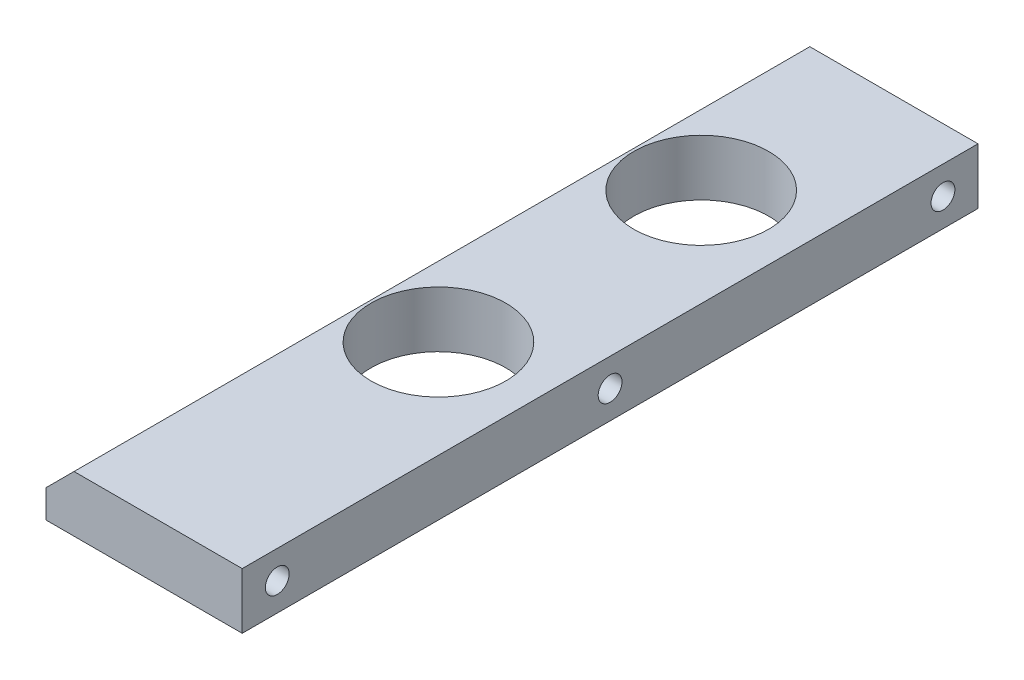
ISO-10303-21;
HEADER;
FILE_DESCRIPTION(('STEP AP214'),'2;1');
FILE_NAME('part.step','',(''),(''),'','','');
FILE_SCHEMA(('AUTOMOTIVE_DESIGN { 1 0 10303 214 1 1 1 1 }'));
ENDSEC;
DATA;
#1=APPLICATION_CONTEXT('core data for automotive mechanical design processes');
#2=APPLICATION_PROTOCOL_DEFINITION('international standard','automotive_design',2000,#1);
#3=PRODUCT_CONTEXT('',#1,'mechanical');
#4=PRODUCT('Part','Part','',(#3));
#5=PRODUCT_RELATED_PRODUCT_CATEGORY('part','',(#4));
#6=PRODUCT_DEFINITION_FORMATION('','',#4);
#7=PRODUCT_DEFINITION_CONTEXT('part definition',#1,'design');
#8=PRODUCT_DEFINITION('design','',#6,#7);
#9=PRODUCT_DEFINITION_SHAPE('','',#8);
#10=(LENGTH_UNIT() NAMED_UNIT(*) SI_UNIT(.MILLI.,.METRE.));
#11=(NAMED_UNIT(*) PLANE_ANGLE_UNIT() SI_UNIT($,.RADIAN.));
#12=(NAMED_UNIT(*) SI_UNIT($,.STERADIAN.) SOLID_ANGLE_UNIT());
#13=UNCERTAINTY_MEASURE_WITH_UNIT(LENGTH_MEASURE(1.E-05),#10,'distance_accuracy_value','');
#14=(GEOMETRIC_REPRESENTATION_CONTEXT(3) GLOBAL_UNCERTAINTY_ASSIGNED_CONTEXT((#13)) GLOBAL_UNIT_ASSIGNED_CONTEXT((#10,
#11,#12)) REPRESENTATION_CONTEXT('',''));
#15=CARTESIAN_POINT('',(0.,0.,0.));
#16=DIRECTION('',(0.,0.,1.));
#17=DIRECTION('',(1.,0.,0.));
#18=AXIS2_PLACEMENT_3D('',#15,#16,#17);
#19=CARTESIAN_POINT('',(13.0000000000337,8.,95.));
#20=DIRECTION('',(1.,0.,0.));
#21=DIRECTION('',(0.,1.,0.));
#22=AXIS2_PLACEMENT_3D('',#19,#20,#21);
#23=CONICAL_SURFACE('',#22,3.3999999999719,1.02974425866659);
#24=CARTESIAN_POINT('',(10.9570738953551,8.00000000006662,95.));
#25=VERTEX_POINT('',#24);
#26=VERTEX_LOOP('',#25);
#27=FACE_BOUND('',#26,.T.);
#28=CARTESIAN_POINT('',(13.,8.,95.));
#29=DIRECTION('',(1.,0.,0.));
#30=DIRECTION('',(0.,0.,-1.));
#31=AXIS2_PLACEMENT_3D('',#28,#29,#30);
#32=CIRCLE('',#31,3.4);
#33=CARTESIAN_POINT('',(13.,8.,91.6));
#34=VERTEX_POINT('',#33);
#35=EDGE_CURVE('E93',#34,#34,#32,.T.);
#36=ORIENTED_EDGE('',*,*,#35,.T.);
#37=EDGE_LOOP('',(#36));
#38=FACE_BOUND('',#37,.T.);
#39=ADVANCED_FACE('F17',(#27,#38),#23,.F.);
#40=CARTESIAN_POINT('',(12.9999999998631,8.,0.));
#41=DIRECTION('',(1.,0.,0.));
#42=DIRECTION('',(0.,1.,0.));
#43=AXIS2_PLACEMENT_3D('',#40,#41,#42);
#44=CONICAL_SURFACE('',#43,3.39999999982865,1.02974425858268);
#45=CARTESIAN_POINT('',(10.9570738951561,8.00000000018031,0.));
#46=VERTEX_POINT('',#45);
#47=VERTEX_LOOP('',#46);
#48=FACE_BOUND('',#47,.T.);
#49=CARTESIAN_POINT('',(13.,8.,0.));
#50=DIRECTION('',(1.,0.,0.));
#51=DIRECTION('',(0.,0.,-1.));
#52=AXIS2_PLACEMENT_3D('',#49,#50,#51);
#53=CIRCLE('',#52,3.4);
#54=CARTESIAN_POINT('',(13.,8.,-3.4));
#55=VERTEX_POINT('',#54);
#56=EDGE_CURVE('E95',#55,#55,#53,.T.);
#57=ORIENTED_EDGE('',*,*,#56,.T.);
#58=EDGE_LOOP('',(#57));
#59=FACE_BOUND('',#58,.T.);
#60=ADVANCED_FACE('F90',(#48,#59),#44,.F.);
#61=CARTESIAN_POINT('',(13.0000000000337,8.,-95.));
#62=DIRECTION('',(1.,0.,0.));
#63=DIRECTION('',(0.,1.,0.));
#64=AXIS2_PLACEMENT_3D('',#61,#62,#63);
#65=CONICAL_SURFACE('',#64,3.39999999996962,1.02974425866599);
#66=CARTESIAN_POINT('',(10.9570738953266,8.00000000000978,-95.));
#67=VERTEX_POINT('',#66);
#68=VERTEX_LOOP('',#67);
#69=FACE_BOUND('',#68,.T.);
#70=CARTESIAN_POINT('',(13.,8.,-95.));
#71=DIRECTION('',(1.,0.,0.));
#72=DIRECTION('',(0.,0.,-1.));
#73=AXIS2_PLACEMENT_3D('',#70,#71,#72);
#74=CIRCLE('',#73,3.4);
#75=CARTESIAN_POINT('',(13.,8.,-98.4));
#76=VERTEX_POINT('',#75);
#77=EDGE_CURVE('E98',#76,#76,#74,.T.);
#78=ORIENTED_EDGE('',*,*,#77,.T.);
#79=EDGE_LOOP('',(#78));
#80=FACE_BOUND('',#79,.T.);
#81=ADVANCED_FACE('F205',(#69,#80),#65,.F.);
#82=CARTESIAN_POINT('',(10.1049275901,8.,95.));
#83=DIRECTION('',(1.,0.,0.));
#84=DIRECTION('',(0.,0.,-1.));
#85=AXIS2_PLACEMENT_3D('',#82,#83,#84);
#86=CYLINDRICAL_SURFACE('',#85,3.4);
#87=ORIENTED_EDGE('',*,*,#35,.F.);
#88=EDGE_LOOP('',(#87));
#89=FACE_BOUND('',#88,.T.);
#90=CARTESIAN_POINT('',(28.,8.,95.));
#91=DIRECTION('',(1.,0.,0.));
#92=DIRECTION('',(0.,0.,-1.));
#93=AXIS2_PLACEMENT_3D('',#90,#91,#92);
#94=CIRCLE('',#93,3.4);
#95=CARTESIAN_POINT('',(28.,8.,91.6));
#96=VERTEX_POINT('',#95);
#97=EDGE_CURVE('E20',#96,#96,#94,.F.);
#98=ORIENTED_EDGE('',*,*,#97,.F.);
#99=EDGE_LOOP('',(#98));
#100=FACE_BOUND('',#99,.T.);
#101=ADVANCED_FACE('F346',(#89,#100),#86,.F.);
#102=CARTESIAN_POINT('',(10.1049275901,8.,0.));
#103=DIRECTION('',(1.,0.,0.));
#104=DIRECTION('',(0.,0.,-1.));
#105=AXIS2_PLACEMENT_3D('',#102,#103,#104);
#106=CYLINDRICAL_SURFACE('',#105,3.4);
#107=ORIENTED_EDGE('',*,*,#56,.F.);
#108=EDGE_LOOP('',(#107));
#109=FACE_BOUND('',#108,.T.);
#110=CARTESIAN_POINT('',(28.,8.,0.));
#111=DIRECTION('',(1.,0.,0.));
#112=DIRECTION('',(0.,0.,-1.));
#113=AXIS2_PLACEMENT_3D('',#110,#111,#112);
#114=CIRCLE('',#113,3.4);
#115=CARTESIAN_POINT('',(28.,8.,-3.4));
#116=VERTEX_POINT('',#115);
#117=EDGE_CURVE('E128',#116,#116,#114,.F.);
#118=ORIENTED_EDGE('',*,*,#117,.F.);
#119=EDGE_LOOP('',(#118));
#120=FACE_BOUND('',#119,.T.);
#121=ADVANCED_FACE('F211',(#109,#120),#106,.F.);
#122=CARTESIAN_POINT('',(10.1049275901,8.,-95.));
#123=DIRECTION('',(1.,0.,0.));
#124=DIRECTION('',(0.,0.,-1.));
#125=AXIS2_PLACEMENT_3D('',#122,#123,#124);
#126=CYLINDRICAL_SURFACE('',#125,3.4);
#127=ORIENTED_EDGE('',*,*,#77,.F.);
#128=EDGE_LOOP('',(#127));
#129=FACE_BOUND('',#128,.T.);
#130=CARTESIAN_POINT('',(28.,8.,-95.));
#131=DIRECTION('',(1.,0.,0.));
#132=DIRECTION('',(0.,0.,-1.));
#133=AXIS2_PLACEMENT_3D('',#130,#131,#132);
#134=CIRCLE('',#133,3.4);
#135=CARTESIAN_POINT('',(28.,8.,-98.4));
#136=VERTEX_POINT('',#135);
#137=EDGE_CURVE('E125',#136,#136,#134,.F.);
#138=ORIENTED_EDGE('',*,*,#137,.F.);
#139=EDGE_LOOP('',(#138));
#140=FACE_BOUND('',#139,.T.);
#141=ADVANCED_FACE('F207',(#129,#140),#126,.F.);
#142=CARTESIAN_POINT('',(-24.,12.,0.));
#143=DIRECTION('',(-0.707106781186548,0.707106781186548,0.));
#144=DIRECTION('',(-0.707106781186548,-0.707106781186548,0.));
#145=AXIS2_PLACEMENT_3D('',#142,#143,#144);
#146=PLANE('',#145);
#147=DIRECTION('',(0.,0.,1.));
#148=VECTOR('',#147,1.);
#149=CARTESIAN_POINT('',(-28.,8.,-105.));
#150=LINE('',#149,#148);
#151=CARTESIAN_POINT('',(-28.,8.,105.));
#152=VERTEX_POINT('',#151);
#153=CARTESIAN_POINT('',(-28.,8.,-105.));
#154=VERTEX_POINT('',#153);
#155=EDGE_CURVE('E154',#152,#154,#150,.F.);
#156=ORIENTED_EDGE('',*,*,#155,.F.);
#157=DIRECTION('',(-0.707106781186548,-0.707106781186548,0.));
#158=VECTOR('',#157,1.);
#159=CARTESIAN_POINT('',(-20.,16.,105.));
#160=LINE('',#159,#158);
#161=CARTESIAN_POINT('',(-20.,16.,105.));
#162=VERTEX_POINT('',#161);
#163=EDGE_CURVE('E142',#162,#152,#160,.T.);
#164=ORIENTED_EDGE('',*,*,#163,.F.);
#165=DIRECTION('',(0.,0.,1.));
#166=VECTOR('',#165,1.);
#167=CARTESIAN_POINT('',(-20.,16.,0.));
#168=LINE('',#167,#166);
#169=CARTESIAN_POINT('',(-20.,16.,-105.));
#170=VERTEX_POINT('',#169);
#171=EDGE_CURVE('E201',#170,#162,#168,.T.);
#172=ORIENTED_EDGE('',*,*,#171,.F.);
#173=DIRECTION('',(0.707106781186548,0.707106781186548,0.));
#174=VECTOR('',#173,1.);
#175=CARTESIAN_POINT('',(-28.,8.,-105.));
#176=LINE('',#175,#174);
#177=EDGE_CURVE('E124',#154,#170,#176,.T.);
#178=ORIENTED_EDGE('',*,*,#177,.F.);
#179=EDGE_LOOP('',(#156,#164,#172,#178));
#180=FACE_BOUND('',#179,.T.);
#181=ADVANCED_FACE('F210',(#180),#146,.T.);
#182=CARTESIAN_POINT('',(0.,16.,0.));
#183=DIRECTION('',(0.,1.,0.));
#184=DIRECTION('',(0.,0.,1.));
#185=AXIS2_PLACEMENT_3D('',#182,#183,#184);
#186=PLANE('',#185);
#187=CARTESIAN_POINT('',(0.,16.,21.));
#188=DIRECTION('',(0.,1.,0.));
#189=DIRECTION('',(0.,0.,1.));
#190=AXIS2_PLACEMENT_3D('',#187,#188,#189);
#191=CIRCLE('',#190,19.25);
#192=CARTESIAN_POINT('',(0.,16.,40.25));
#193=VERTEX_POINT('',#192);
#194=EDGE_CURVE('E117',#193,#193,#191,.F.);
#195=ORIENTED_EDGE('',*,*,#194,.T.);
#196=EDGE_LOOP('',(#195));
#197=FACE_BOUND('',#196,.T.);
#198=CARTESIAN_POINT('',(0.,16.,-54.));
#199=DIRECTION('',(0.,1.,0.));
#200=DIRECTION('',(0.,0.,1.));
#201=AXIS2_PLACEMENT_3D('',#198,#199,#200);
#202=CIRCLE('',#201,19.25);
#203=CARTESIAN_POINT('',(0.,16.,-34.75));
#204=VERTEX_POINT('',#203);
#205=EDGE_CURVE('E121',#204,#204,#202,.F.);
#206=ORIENTED_EDGE('',*,*,#205,.T.);
#207=EDGE_LOOP('',(#206));
#208=FACE_BOUND('',#207,.T.);
#209=DIRECTION('',(-1.,0.,0.));
#210=VECTOR('',#209,1.);
#211=CARTESIAN_POINT('',(28.,16.,-105.));
#212=LINE('',#211,#210);
#213=CARTESIAN_POINT('',(28.,16.,-105.));
#214=VERTEX_POINT('',#213);
#215=EDGE_CURVE('E127',#170,#214,#212,.F.);
#216=ORIENTED_EDGE('',*,*,#215,.F.);
#217=ORIENTED_EDGE('',*,*,#171,.T.);
#218=DIRECTION('',(1.,0.,0.));
#219=VECTOR('',#218,1.);
#220=CARTESIAN_POINT('',(-28.,16.,105.));
#221=LINE('',#220,#219);
#222=CARTESIAN_POINT('',(28.,16.,105.));
#223=VERTEX_POINT('',#222);
#224=EDGE_CURVE('E149',#223,#162,#221,.F.);
#225=ORIENTED_EDGE('',*,*,#224,.F.);
#226=DIRECTION('',(0.,0.,-1.));
#227=VECTOR('',#226,1.);
#228=CARTESIAN_POINT('',(28.,16.,105.));
#229=LINE('',#228,#227);
#230=EDGE_CURVE('E136',#214,#223,#229,.F.);
#231=ORIENTED_EDGE('',*,*,#230,.F.);
#232=EDGE_LOOP('',(#216,#217,#225,#231));
#233=FACE_BOUND('',#232,.T.);
#234=ADVANCED_FACE('F288',(#197,#208,#233),#186,.T.);
#235=CARTESIAN_POINT('',(-14.3,11.0000000000241,-78.7));
#236=DIRECTION('',(0.,-1.,0.));
#237=DIRECTION('',(0.,0.,-1.));
#238=AXIS2_PLACEMENT_3D('',#235,#236,#237);
#239=CONICAL_SURFACE('',#238,2.49999999997154,1.02974425866932);
#240=CARTESIAN_POINT('',(-14.3,11.,-78.7));
#241=DIRECTION('',(0.,-1.,0.));
#242=DIRECTION('',(0.,0.,-1.));
#243=AXIS2_PLACEMENT_3D('',#240,#241,#242);
#244=CIRCLE('',#243,2.5);
#245=CARTESIAN_POINT('',(-14.3,11.,-81.2));
#246=VERTEX_POINT('',#245);
#247=EDGE_CURVE('E120',#246,#246,#244,.T.);
#248=ORIENTED_EDGE('',*,*,#247,.T.);
#249=EDGE_LOOP('',(#248));
#250=FACE_BOUND('',#249,.T.);
#251=CARTESIAN_POINT('',(-14.2999999999631,12.5021515475225,-78.7));
#252=VERTEX_POINT('',#251);
#253=VERTEX_LOOP('',#252);
#254=FACE_BOUND('',#253,.T.);
#255=ADVANCED_FACE('F328',(#250,#254),#239,.F.);
#256=CARTESIAN_POINT('',(-14.3,11.0000000000809,-3.7));
#257=DIRECTION('',(0.,-1.,0.));
#258=DIRECTION('',(0.,0.,-1.));
#259=AXIS2_PLACEMENT_3D('',#256,#257,#258);
#260=CONICAL_SURFACE('',#259,2.50000000003529,1.02974425868861);
#261=CARTESIAN_POINT('',(-16.800000000017,11.0000000000241,-3.7));
#262=CARTESIAN_POINT('',(-16.6958333333342,11.0625896478075,-3.69999999999947));
#263=CARTESIAN_POINT('',(-16.5916666666701,11.1251792956221,-3.69999999999901));
#264=CARTESIAN_POINT('',(-16.3833333333419,11.2503585912702,-3.69999999999822));
#265=CARTESIAN_POINT('',(-16.2791666666778,11.3129482391038,-3.69999999999789));
#266=CARTESIAN_POINT('',(-16.0708333333373,11.4381275347313,-3.69999999999736));
#267=CARTESIAN_POINT('',(-15.9666666666608,11.5007171825252,-3.69999999999717));
#268=CARTESIAN_POINT('',(-15.758333333324,11.625896478159,-3.6999999999969));
#269=CARTESIAN_POINT('',(-15.6541666666637,11.6884861259988,-3.69999999999684));
#270=CARTESIAN_POINT('',(-15.4458333333241,11.813665421628,-3.69999999999684));
#271=CARTESIAN_POINT('',(-15.3416666666449,11.8762550694174,-3.6999999999969));
#272=CARTESIAN_POINT('',(-15.1333333333265,12.0014343650503,-3.69999999999717));
#273=CARTESIAN_POINT('',(-15.0291666666874,12.0640240128939,-3.69999999999736));
#274=CARTESIAN_POINT('',(-14.8208333333729,12.1892033085332,-3.69999999999789));
#275=CARTESIAN_POINT('',(-14.7166666666974,12.2517929563288,-3.69999999999822));
#276=CARTESIAN_POINT('',(-14.5083333333464,12.3769722519391,-3.69999999999901));
#277=CARTESIAN_POINT('',(-14.404166666671,12.4395618997536,-3.69999999999947));
#278=CARTESIAN_POINT('',(-14.3000000000193,12.5021515476078,-3.7));
#279=B_SPLINE_CURVE_WITH_KNOTS('',3,(#261,#262,#263,#264,#265,#266,#267,#268,#269,#270,#271,
#272,#273,#274,#275,#276,#277,#278),.UNSPECIFIED.,.F.,.F.,(4,2,2,2,2,2,2,2,4),(0.,
0.364572936621953,0.729145873273182,1.09371880989513,1.45829174654637,1.82286468316832,
2.18743761977082,2.55201055639278,2.916583493044),.UNSPECIFIED.);
#280=CARTESIAN_POINT('',(-16.8000000000042,11.000000000006,-3.7));
#281=VERTEX_POINT('',#280);
#282=CARTESIAN_POINT('',(-14.3,12.5021515476078,-3.7));
#283=VERTEX_POINT('',#282);
#284=EDGE_CURVE('E156',#281,#283,#279,.T.);
#285=ORIENTED_EDGE('',*,*,#284,.T.);
#286=CARTESIAN_POINT('',(-14.2999999999807,12.5021515476078,-3.7));
#287=CARTESIAN_POINT('',(-14.195833333329,12.4395618997536,-3.69999999999947));
#288=CARTESIAN_POINT('',(-14.0916666666536,12.3769722519391,-3.69999999999901));
#289=CARTESIAN_POINT('',(-13.8833333333026,12.2517929563288,-3.69999999999822));
#290=CARTESIAN_POINT('',(-13.7791666666271,12.1892033085332,-3.69999999999789));
#291=CARTESIAN_POINT('',(-13.5708333333126,12.0640240128939,-3.69999999999736));
#292=CARTESIAN_POINT('',(-13.4666666666735,12.0014343650503,-3.69999999999717));
#293=CARTESIAN_POINT('',(-13.2583333333551,11.8762550694174,-3.6999999999969));
#294=CARTESIAN_POINT('',(-13.1541666666759,11.813665421628,-3.69999999999684));
#295=CARTESIAN_POINT('',(-12.9458333333363,11.6884861259988,-3.69999999999684));
#296=CARTESIAN_POINT('',(-12.841666666676,11.625896478159,-3.6999999999969));
#297=CARTESIAN_POINT('',(-12.6333333333392,11.5007171825252,-3.69999999999717));
#298=CARTESIAN_POINT('',(-12.5291666666627,11.4381275347313,-3.69999999999737));
#299=CARTESIAN_POINT('',(-12.3208333333222,11.3129482391038,-3.69999999999789));
#300=CARTESIAN_POINT('',(-12.2166666666581,11.2503585912702,-3.69999999999822));
#301=CARTESIAN_POINT('',(-12.0083333333299,11.1251792956221,-3.69999999999901));
#302=CARTESIAN_POINT('',(-11.9041666666658,11.0625896478075,-3.69999999999947));
#303=CARTESIAN_POINT('',(-11.799999999983,11.0000000000241,-3.7));
#304=B_SPLINE_CURVE_WITH_KNOTS('',3,(#286,#287,#288,#289,#290,#291,#292,#293,#294,#295,#296,
#297,#298,#299,#300,#301,#302,#303),.UNSPECIFIED.,.F.,.F.,(4,2,2,2,2,2,2,2,4),(0.,
0.364572936651229,0.729145873273182,1.09371880987569,1.45829174649764,1.82286468314887,
2.18743761977082,2.55201055642205,2.916583493044),.UNSPECIFIED.);
#305=CARTESIAN_POINT('',(-11.7999999999957,11.000000000006,-3.7));
#306=VERTEX_POINT('',#305);
#307=EDGE_CURVE('E176',#283,#306,#304,.T.);
#308=ORIENTED_EDGE('',*,*,#307,.T.);
#309=CARTESIAN_POINT('',(-14.3,11.,-3.7));
#310=DIRECTION('',(0.,-1.,0.));
#311=DIRECTION('',(0.,0.,-1.));
#312=AXIS2_PLACEMENT_3D('',#309,#310,#311);
#313=CIRCLE('',#312,2.5);
#314=EDGE_CURVE('E165',#306,#281,#313,.T.);
#315=ORIENTED_EDGE('',*,*,#314,.T.);
#316=EDGE_LOOP('',(#285,#308,#315));
#317=FACE_BOUND('',#316,.T.);
#318=ADVANCED_FACE('F310',(#317),#260,.F.);
#319=CARTESIAN_POINT('',(-14.3,11.0000000000241,-3.7));
#320=DIRECTION('',(0.,-1.,0.));
#321=DIRECTION('',(0.,0.,-1.));
#322=AXIS2_PLACEMENT_3D('',#319,#320,#321);
#323=CONICAL_SURFACE('',#322,2.50000000001701,1.0297442586719);
#324=CARTESIAN_POINT('',(-14.3,11.,-3.7));
#325=DIRECTION('',(0.,-1.,0.));
#326=DIRECTION('',(0.,0.,-1.));
#327=AXIS2_PLACEMENT_3D('',#324,#325,#326);
#328=CIRCLE('',#327,2.5);
#329=EDGE_CURVE('E164',#281,#306,#328,.T.);
#330=ORIENTED_EDGE('',*,*,#329,.T.);
#331=ORIENTED_EDGE('',*,*,#307,.F.);
#332=ORIENTED_EDGE('',*,*,#284,.F.);
#333=EDGE_LOOP('',(#330,#331,#332));
#334=FACE_BOUND('',#333,.T.);
#335=ADVANCED_FACE('F184',(#334),#323,.F.);
#336=CARTESIAN_POINT('',(14.3,10.9999999999673,-29.3));
#337=DIRECTION('',(0.,-1.,0.));
#338=DIRECTION('',(0.,0.,-1.));
#339=AXIS2_PLACEMENT_3D('',#336,#337,#338);
#340=CONICAL_SURFACE('',#339,2.50000000001983,1.02974425867857);
#341=CARTESIAN_POINT('',(14.3,11.,-29.3));
#342=DIRECTION('',(0.,-1.,0.));
#343=DIRECTION('',(0.,0.,-1.));
#344=AXIS2_PLACEMENT_3D('',#341,#342,#343);
#345=CIRCLE('',#344,2.5);
#346=CARTESIAN_POINT('',(14.3,11.,-31.8));
#347=VERTEX_POINT('',#346);
#348=EDGE_CURVE('E161',#347,#347,#345,.T.);
#349=ORIENTED_EDGE('',*,*,#348,.T.);
#350=EDGE_LOOP('',(#349));
#351=FACE_BOUND('',#350,.T.);
#352=CARTESIAN_POINT('',(14.30000000002,12.502151547551,-29.3));
#353=VERTEX_POINT('',#352);
#354=VERTEX_LOOP('',#353);
#355=FACE_BOUND('',#354,.T.);
#356=ADVANCED_FACE('F182',(#351,#355),#340,.F.);
#357=CARTESIAN_POINT('',(14.3,11.0000000000809,45.7));
#358=DIRECTION('',(0.,-1.,0.));
#359=DIRECTION('',(0.,0.,-1.));
#360=AXIS2_PLACEMENT_3D('',#357,#358,#359);
#361=CONICAL_SURFACE('',#360,2.49999999978108,1.02974425852182);
#362=CARTESIAN_POINT('',(14.3,11.,45.7));
#363=DIRECTION('',(0.,-1.,0.));
#364=DIRECTION('',(0.,0.,-1.));
#365=AXIS2_PLACEMENT_3D('',#362,#363,#364);
#366=CIRCLE('',#365,2.5);
#367=CARTESIAN_POINT('',(14.3,11.,43.2));
#368=VERTEX_POINT('',#367);
#369=EDGE_CURVE('E157',#368,#368,#366,.T.);
#370=ORIENTED_EDGE('',*,*,#369,.T.);
#371=EDGE_LOOP('',(#370));
#372=FACE_BOUND('',#371,.T.);
#373=CARTESIAN_POINT('',(14.3000000002473,12.5021515476362,45.7));
#374=VERTEX_POINT('',#373);
#375=VERTEX_LOOP('',#374);
#376=FACE_BOUND('',#375,.T.);
#377=ADVANCED_FACE('F294',(#372,#376),#361,.F.);
#378=CARTESIAN_POINT('',(-28.,0.,-105.));
#379=DIRECTION('',(-1.,0.,0.));
#380=DIRECTION('',(0.,0.,1.));
#381=AXIS2_PLACEMENT_3D('',#378,#379,#380);
#382=PLANE('',#381);
#383=DIRECTION('',(0.,1.,0.));
#384=VECTOR('',#383,1.);
#385=CARTESIAN_POINT('',(-28.,0.,105.));
#386=LINE('',#385,#384);
#387=CARTESIAN_POINT('',(-28.,0.,105.));
#388=VERTEX_POINT('',#387);
#389=EDGE_CURVE('E152',#152,#388,#386,.F.);
#390=ORIENTED_EDGE('',*,*,#389,.F.);
#391=ORIENTED_EDGE('',*,*,#155,.T.);
#392=DIRECTION('',(0.,1.,0.));
#393=VECTOR('',#392,1.);
#394=CARTESIAN_POINT('',(-28.,0.,-105.));
#395=LINE('',#394,#393);
#396=CARTESIAN_POINT('',(-28.,0.,-105.));
#397=VERTEX_POINT('',#396);
#398=EDGE_CURVE('E281',#397,#154,#395,.T.);
#399=ORIENTED_EDGE('',*,*,#398,.F.);
#400=DIRECTION('',(0.,0.,1.));
#401=VECTOR('',#400,1.);
#402=CARTESIAN_POINT('',(-28.,0.,0.));
#403=LINE('',#402,#401);
#404=EDGE_CURVE('E160',#397,#388,#403,.T.);
#405=ORIENTED_EDGE('',*,*,#404,.T.);
#406=EDGE_LOOP('',(#390,#391,#399,#405));
#407=FACE_BOUND('',#406,.T.);
#408=ADVANCED_FACE('F227',(#407),#382,.T.);
#409=CARTESIAN_POINT('',(-28.,0.,105.));
#410=DIRECTION('',(0.,0.,1.));
#411=DIRECTION('',(1.,0.,0.));
#412=AXIS2_PLACEMENT_3D('',#409,#410,#411);
#413=PLANE('',#412);
#414=ORIENTED_EDGE('',*,*,#224,.T.);
#415=ORIENTED_EDGE('',*,*,#163,.T.);
#416=ORIENTED_EDGE('',*,*,#389,.T.);
#417=DIRECTION('',(1.,0.,0.));
#418=VECTOR('',#417,1.);
#419=CARTESIAN_POINT('',(0.,0.,105.));
#420=LINE('',#419,#418);
#421=CARTESIAN_POINT('',(28.,0.,105.));
#422=VERTEX_POINT('',#421);
#423=EDGE_CURVE('E271',#388,#422,#420,.T.);
#424=ORIENTED_EDGE('',*,*,#423,.T.);
#425=DIRECTION('',(0.,1.,0.));
#426=VECTOR('',#425,1.);
#427=CARTESIAN_POINT('',(28.,0.,105.));
#428=LINE('',#427,#426);
#429=EDGE_CURVE('E133',#223,#422,#428,.F.);
#430=ORIENTED_EDGE('',*,*,#429,.F.);
#431=EDGE_LOOP('',(#414,#415,#416,#424,#430));
#432=FACE_BOUND('',#431,.T.);
#433=ADVANCED_FACE('F218',(#432),#413,.T.);
#434=CARTESIAN_POINT('',(28.,0.,105.));
#435=DIRECTION('',(1.,0.,0.));
#436=DIRECTION('',(0.,0.,-1.));
#437=AXIS2_PLACEMENT_3D('',#434,#435,#436);
#438=PLANE('',#437);
#439=ORIENTED_EDGE('',*,*,#137,.T.);
#440=EDGE_LOOP('',(#439));
#441=FACE_BOUND('',#440,.T.);
#442=ORIENTED_EDGE('',*,*,#117,.T.);
#443=EDGE_LOOP('',(#442));
#444=FACE_BOUND('',#443,.T.);
#445=ORIENTED_EDGE('',*,*,#97,.T.);
#446=EDGE_LOOP('',(#445));
#447=FACE_BOUND('',#446,.T.);
#448=ORIENTED_EDGE('',*,*,#429,.T.);
#449=DIRECTION('',(0.,0.,1.));
#450=VECTOR('',#449,1.);
#451=CARTESIAN_POINT('',(28.,0.,0.));
#452=LINE('',#451,#450);
#453=CARTESIAN_POINT('',(28.,0.,-105.));
#454=VERTEX_POINT('',#453);
#455=EDGE_CURVE('E269',#422,#454,#452,.F.);
#456=ORIENTED_EDGE('',*,*,#455,.T.);
#457=DIRECTION('',(0.,1.,0.));
#458=VECTOR('',#457,1.);
#459=CARTESIAN_POINT('',(28.,0.,-105.));
#460=LINE('',#459,#458);
#461=EDGE_CURVE('E35',#214,#454,#460,.F.);
#462=ORIENTED_EDGE('',*,*,#461,.F.);
#463=ORIENTED_EDGE('',*,*,#230,.T.);
#464=EDGE_LOOP('',(#448,#456,#462,#463));
#465=FACE_BOUND('',#464,.T.);
#466=ADVANCED_FACE('F215',(#441,#444,#447,#465),#438,.T.);
#467=CARTESIAN_POINT('',(28.,0.,-105.));
#468=DIRECTION('',(0.,0.,-1.));
#469=DIRECTION('',(-1.,0.,0.));
#470=AXIS2_PLACEMENT_3D('',#467,#468,#469);
#471=PLANE('',#470);
#472=ORIENTED_EDGE('',*,*,#398,.T.);
#473=ORIENTED_EDGE('',*,*,#177,.T.);
#474=ORIENTED_EDGE('',*,*,#215,.T.);
#475=ORIENTED_EDGE('',*,*,#461,.T.);
#476=DIRECTION('',(1.,0.,0.));
#477=VECTOR('',#476,1.);
#478=CARTESIAN_POINT('',(0.,0.,-105.));
#479=LINE('',#478,#477);
#480=EDGE_CURVE('E116',#454,#397,#479,.F.);
#481=ORIENTED_EDGE('',*,*,#480,.T.);
#482=EDGE_LOOP('',(#472,#473,#474,#475,#481));
#483=FACE_BOUND('',#482,.T.);
#484=ADVANCED_FACE('F217',(#483),#471,.T.);
#485=CARTESIAN_POINT('',(0.,0.,-54.));
#486=DIRECTION('',(0.,1.,0.));
#487=DIRECTION('',(0.,0.,1.));
#488=AXIS2_PLACEMENT_3D('',#485,#486,#487);
#489=CYLINDRICAL_SURFACE('',#488,19.25);
#490=ORIENTED_EDGE('',*,*,#205,.F.);
#491=EDGE_LOOP('',(#490));
#492=FACE_BOUND('',#491,.T.);
#493=CARTESIAN_POINT('',(0.,0.,-54.));
#494=DIRECTION('',(0.,1.,0.));
#495=DIRECTION('',(0.,0.,1.));
#496=AXIS2_PLACEMENT_3D('',#493,#494,#495);
#497=CIRCLE('',#496,19.25);
#498=CARTESIAN_POINT('',(0.,0.,-34.75));
#499=VERTEX_POINT('',#498);
#500=EDGE_CURVE('E113',#499,#499,#497,.F.);
#501=ORIENTED_EDGE('',*,*,#500,.T.);
#502=EDGE_LOOP('',(#501));
#503=FACE_BOUND('',#502,.T.);
#504=ADVANCED_FACE('F225',(#492,#503),#489,.F.);
#505=CARTESIAN_POINT('',(0.,0.,21.));
#506=DIRECTION('',(0.,1.,0.));
#507=DIRECTION('',(0.,0.,1.));
#508=AXIS2_PLACEMENT_3D('',#505,#506,#507);
#509=CYLINDRICAL_SURFACE('',#508,19.25);
#510=ORIENTED_EDGE('',*,*,#194,.F.);
#511=EDGE_LOOP('',(#510));
#512=FACE_BOUND('',#511,.T.);
#513=CARTESIAN_POINT('',(0.,0.,21.));
#514=DIRECTION('',(0.,1.,0.));
#515=DIRECTION('',(0.,0.,1.));
#516=AXIS2_PLACEMENT_3D('',#513,#514,#515);
#517=CIRCLE('',#516,19.25);
#518=CARTESIAN_POINT('',(0.,0.,40.25));
#519=VERTEX_POINT('',#518);
#520=EDGE_CURVE('E110',#519,#519,#517,.F.);
#521=ORIENTED_EDGE('',*,*,#520,.T.);
#522=EDGE_LOOP('',(#521));
#523=FACE_BOUND('',#522,.T.);
#524=ADVANCED_FACE('F254',(#512,#523),#509,.F.);
#525=CARTESIAN_POINT('',(-14.3,13.1272591249,-78.7));
#526=DIRECTION('',(0.,-1.,0.));
#527=DIRECTION('',(0.,0.,-1.));
#528=AXIS2_PLACEMENT_3D('',#525,#526,#527);
#529=CYLINDRICAL_SURFACE('',#528,2.5);
#530=ORIENTED_EDGE('',*,*,#247,.F.);
#531=EDGE_LOOP('',(#530));
#532=FACE_BOUND('',#531,.T.);
#533=CARTESIAN_POINT('',(-14.3,0.,-78.7));
#534=DIRECTION('',(0.,-1.,0.));
#535=DIRECTION('',(0.,0.,-1.));
#536=AXIS2_PLACEMENT_3D('',#533,#534,#535);
#537=CIRCLE('',#536,2.5);
#538=CARTESIAN_POINT('',(-14.3,0.,-81.2));
#539=VERTEX_POINT('',#538);
#540=EDGE_CURVE('E107',#539,#539,#537,.T.);
#541=ORIENTED_EDGE('',*,*,#540,.T.);
#542=EDGE_LOOP('',(#541));
#543=FACE_BOUND('',#542,.T.);
#544=ADVANCED_FACE('F250',(#532,#543),#529,.F.);
#545=CARTESIAN_POINT('',(-14.3,13.1272591249,-3.7));
#546=DIRECTION('',(0.,-1.,0.));
#547=DIRECTION('',(0.,0.,-1.));
#548=AXIS2_PLACEMENT_3D('',#545,#546,#547);
#549=CYLINDRICAL_SURFACE('',#548,2.5);
#550=ORIENTED_EDGE('',*,*,#329,.F.);
#551=ORIENTED_EDGE('',*,*,#314,.F.);
#552=EDGE_LOOP('',(#550,#551));
#553=FACE_BOUND('',#552,.T.);
#554=CARTESIAN_POINT('',(-14.3,0.,-3.7));
#555=DIRECTION('',(0.,-1.,0.));
#556=DIRECTION('',(0.,0.,-1.));
#557=AXIS2_PLACEMENT_3D('',#554,#555,#556);
#558=CIRCLE('',#557,2.5);
#559=CARTESIAN_POINT('',(-14.3,0.,-6.2));
#560=VERTEX_POINT('',#559);
#561=EDGE_CURVE('E104',#560,#560,#558,.T.);
#562=ORIENTED_EDGE('',*,*,#561,.T.);
#563=EDGE_LOOP('',(#562));
#564=FACE_BOUND('',#563,.T.);
#565=ADVANCED_FACE('F246',(#553,#564),#549,.F.);
#566=CARTESIAN_POINT('',(14.3,13.1272591249,-29.3));
#567=DIRECTION('',(0.,-1.,0.));
#568=DIRECTION('',(0.,0.,-1.));
#569=AXIS2_PLACEMENT_3D('',#566,#567,#568);
#570=CYLINDRICAL_SURFACE('',#569,2.5);
#571=ORIENTED_EDGE('',*,*,#348,.F.);
#572=EDGE_LOOP('',(#571));
#573=FACE_BOUND('',#572,.T.);
#574=CARTESIAN_POINT('',(14.3,0.,-29.3));
#575=DIRECTION('',(0.,-1.,0.));
#576=DIRECTION('',(0.,0.,-1.));
#577=AXIS2_PLACEMENT_3D('',#574,#575,#576);
#578=CIRCLE('',#577,2.5);
#579=CARTESIAN_POINT('',(14.3,0.,-31.8));
#580=VERTEX_POINT('',#579);
#581=EDGE_CURVE('E26',#580,#580,#578,.T.);
#582=ORIENTED_EDGE('',*,*,#581,.T.);
#583=EDGE_LOOP('',(#582));
#584=FACE_BOUND('',#583,.T.);
#585=ADVANCED_FACE('F238',(#573,#584),#570,.F.);
#586=CARTESIAN_POINT('',(14.3,13.1272591249,45.7));
#587=DIRECTION('',(0.,-1.,0.));
#588=DIRECTION('',(0.,0.,-1.));
#589=AXIS2_PLACEMENT_3D('',#586,#587,#588);
#590=CYLINDRICAL_SURFACE('',#589,2.5);
#591=ORIENTED_EDGE('',*,*,#369,.F.);
#592=EDGE_LOOP('',(#591));
#593=FACE_BOUND('',#592,.T.);
#594=CARTESIAN_POINT('',(14.3,0.,45.7));
#595=DIRECTION('',(0.,-1.,0.));
#596=DIRECTION('',(0.,0.,-1.));
#597=AXIS2_PLACEMENT_3D('',#594,#595,#596);
#598=CIRCLE('',#597,2.5);
#599=CARTESIAN_POINT('',(14.3,0.,43.2));
#600=VERTEX_POINT('',#599);
#601=EDGE_CURVE('E11',#600,#600,#598,.T.);
#602=ORIENTED_EDGE('',*,*,#601,.T.);
#603=EDGE_LOOP('',(#602));
#604=FACE_BOUND('',#603,.T.);
#605=ADVANCED_FACE('F232',(#593,#604),#590,.F.);
#606=CARTESIAN_POINT('',(0.,0.,0.));
#607=DIRECTION('',(0.,1.,0.));
#608=DIRECTION('',(0.,0.,1.));
#609=AXIS2_PLACEMENT_3D('',#606,#607,#608);
#610=PLANE('',#609);
#611=ORIENTED_EDGE('',*,*,#601,.F.);
#612=EDGE_LOOP('',(#611));
#613=FACE_BOUND('',#612,.T.);
#614=ORIENTED_EDGE('',*,*,#581,.F.);
#615=EDGE_LOOP('',(#614));
#616=FACE_BOUND('',#615,.T.);
#617=ORIENTED_EDGE('',*,*,#561,.F.);
#618=EDGE_LOOP('',(#617));
#619=FACE_BOUND('',#618,.T.);
#620=ORIENTED_EDGE('',*,*,#540,.F.);
#621=EDGE_LOOP('',(#620));
#622=FACE_BOUND('',#621,.T.);
#623=ORIENTED_EDGE('',*,*,#520,.F.);
#624=EDGE_LOOP('',(#623));
#625=FACE_BOUND('',#624,.T.);
#626=ORIENTED_EDGE('',*,*,#500,.F.);
#627=EDGE_LOOP('',(#626));
#628=FACE_BOUND('',#627,.T.);
#629=ORIENTED_EDGE('',*,*,#455,.F.);
#630=ORIENTED_EDGE('',*,*,#423,.F.);
#631=ORIENTED_EDGE('',*,*,#404,.F.);
#632=ORIENTED_EDGE('',*,*,#480,.F.);
#633=EDGE_LOOP('',(#629,#630,#631,#632));
#634=FACE_BOUND('',#633,.T.);
#635=ADVANCED_FACE('F230',(#613,#616,#619,#622,#625,#628,#634),#610,.F.);
#636=CLOSED_SHELL('',(#39,#60,#81,#101,#121,#141,#181,#234,#255,#318,#335,#356,#377,#408,#433,
#466,#484,#504,#524,#544,#565,#585,#605,#635));
#637=MANIFOLD_SOLID_BREP('B1',#636);
#638=ADVANCED_BREP_SHAPE_REPRESENTATION('',(#18,#637),#14);
#639=SHAPE_DEFINITION_REPRESENTATION(#9,#638);
ENDSEC;
END-ISO-10303-21;
